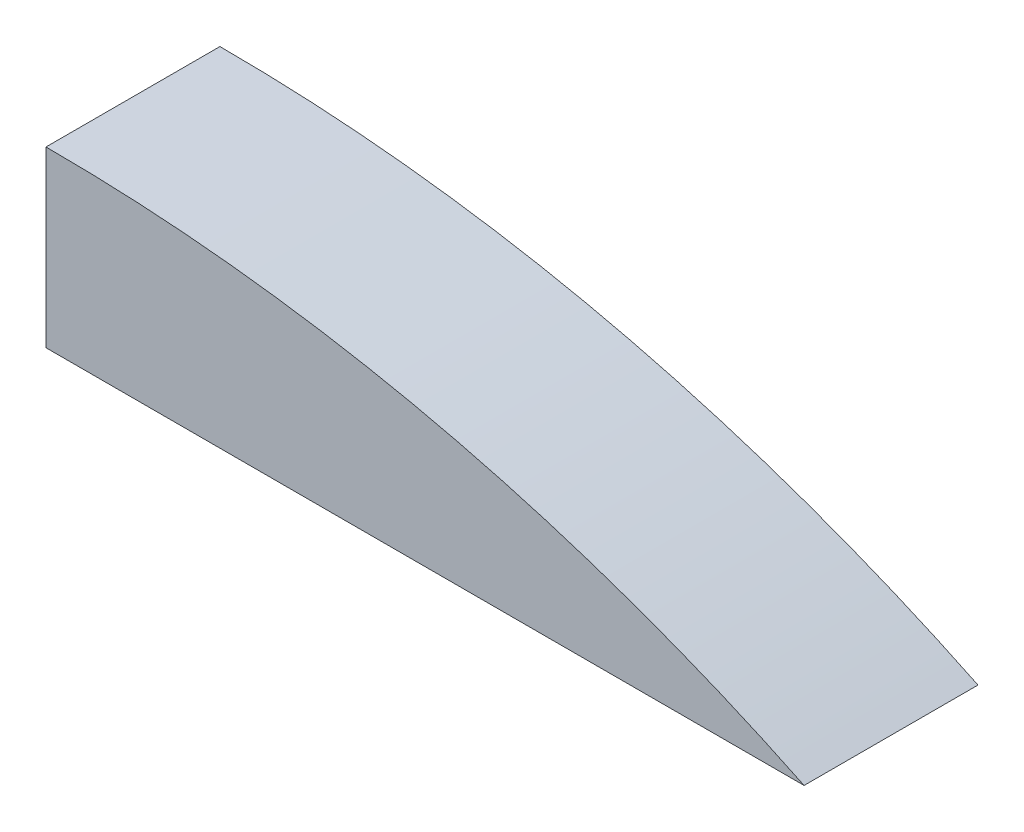
ISO-10303-21;
HEADER;
FILE_DESCRIPTION(('STEP AP214'),'2;1');
FILE_NAME('part.step','',(''),(''),'','','');
FILE_SCHEMA(('AUTOMOTIVE_DESIGN { 1 0 10303 214 1 1 1 1 }'));
ENDSEC;
DATA;
#1=APPLICATION_CONTEXT('core data for automotive mechanical design processes');
#2=APPLICATION_PROTOCOL_DEFINITION('international standard','automotive_design',2000,#1);
#3=PRODUCT_CONTEXT('',#1,'mechanical');
#4=PRODUCT('Part','Part','',(#3));
#5=PRODUCT_RELATED_PRODUCT_CATEGORY('part','',(#4));
#6=PRODUCT_DEFINITION_FORMATION('','',#4);
#7=PRODUCT_DEFINITION_CONTEXT('part definition',#1,'design');
#8=PRODUCT_DEFINITION('design','',#6,#7);
#9=PRODUCT_DEFINITION_SHAPE('','',#8);
#10=(LENGTH_UNIT() NAMED_UNIT(*) SI_UNIT(.MILLI.,.METRE.));
#11=(NAMED_UNIT(*) PLANE_ANGLE_UNIT() SI_UNIT($,.RADIAN.));
#12=(NAMED_UNIT(*) SI_UNIT($,.STERADIAN.) SOLID_ANGLE_UNIT());
#13=UNCERTAINTY_MEASURE_WITH_UNIT(LENGTH_MEASURE(1.E-05),#10,'distance_accuracy_value','');
#14=(GEOMETRIC_REPRESENTATION_CONTEXT(3) GLOBAL_UNCERTAINTY_ASSIGNED_CONTEXT((#13)) GLOBAL_UNIT_ASSIGNED_CONTEXT((#10,
#11,#12)) REPRESENTATION_CONTEXT('',''));
#15=CARTESIAN_POINT('',(0.,0.,0.));
#16=DIRECTION('',(0.,0.,1.));
#17=DIRECTION('',(1.,0.,0.));
#18=AXIS2_PLACEMENT_3D('',#15,#16,#17);
#19=CARTESIAN_POINT('',(597.266258042068,0.,0.));
#20=DIRECTION('',(-1.,0.,0.));
#21=DIRECTION('',(0.,0.,1.));
#22=AXIS2_PLACEMENT_3D('',#19,#20,#21);
#23=PLANE('',#22);
#24=DIRECTION('',(0.,0.,-1.));
#25=VECTOR('',#24,1.);
#26=CARTESIAN_POINT('',(597.266258042068,50.,80.));
#27=LINE('',#26,#25);
#28=CARTESIAN_POINT('',(597.266258042068,50.,5.));
#29=VERTEX_POINT('',#28);
#30=CARTESIAN_POINT('',(597.266258042068,50.,0.));
#31=VERTEX_POINT('',#30);
#32=EDGE_CURVE('E78',#29,#31,#27,.T.);
#33=ORIENTED_EDGE('',*,*,#32,.T.);
#34=DIRECTION('',(0.,-1.,0.));
#35=VECTOR('',#34,1.);
#36=CARTESIAN_POINT('',(597.266258042068,0.,0.));
#37=LINE('',#36,#35);
#38=CARTESIAN_POINT('',(597.266258042068,45.,0.));
#39=VERTEX_POINT('',#38);
#40=EDGE_CURVE('E83',#31,#39,#37,.T.);
#41=ORIENTED_EDGE('',*,*,#40,.T.);
#42=DIRECTION('',(0.,0.,-1.));
#43=VECTOR('',#42,1.);
#44=CARTESIAN_POINT('',(597.266258042068,45.,0.));
#45=LINE('',#44,#43);
#46=CARTESIAN_POINT('',(597.266258042068,45.,5.));
#47=VERTEX_POINT('',#46);
#48=EDGE_CURVE('E79',#47,#39,#45,.T.);
#49=ORIENTED_EDGE('',*,*,#48,.F.);
#50=DIRECTION('',(0.,-1.,0.));
#51=VECTOR('',#50,1.);
#52=CARTESIAN_POINT('',(597.266258042068,-45.,5.));
#53=LINE('',#52,#51);
#54=EDGE_CURVE('E68',#29,#47,#53,.T.);
#55=ORIENTED_EDGE('',*,*,#54,.F.);
#56=EDGE_LOOP('',(#33,#41,#49,#55));
#57=FACE_BOUND('',#56,.T.);
#58=ADVANCED_FACE('F34',(#57),#23,.T.);
#59=CARTESIAN_POINT('',(-502.733741957931,0.,0.));
#60=DIRECTION('',(0.,0.,1.));
#61=DIRECTION('',(1.,0.,0.));
#62=AXIS2_PLACEMENT_3D('',#59,#60,#61);
#63=PLANE('',#62);
#64=ORIENTED_EDGE('',*,*,#40,.F.);
#65=CARTESIAN_POINT('',(597.266258042068,0.,0.));
#66=DIRECTION('',(0.,0.,1.));
#67=DIRECTION('',(1.,0.,0.));
#68=AXIS2_PLACEMENT_3D('',#65,#66,#67);
#69=CIRCLE('',#68,50.);
#70=CARTESIAN_POINT('',(619.060752759772,45.,0.));
#71=VERTEX_POINT('',#70);
#72=EDGE_CURVE('E73',#71,#31,#69,.T.);
#73=ORIENTED_EDGE('',*,*,#72,.F.);
#74=DIRECTION('',(1.,0.,0.));
#75=VECTOR('',#74,1.);
#76=CARTESIAN_POINT('',(-502.733741957931,45.,0.));
#77=LINE('',#76,#75);
#78=EDGE_CURVE('E38',#39,#71,#77,.T.);
#79=ORIENTED_EDGE('',*,*,#78,.F.);
#80=EDGE_LOOP('',(#64,#73,#79));
#81=FACE_BOUND('',#80,.T.);
#82=ADVANCED_FACE('F90',(#81),#63,.F.);
#83=CARTESIAN_POINT('',(0.,45.,0.));
#84=DIRECTION('',(0.,-1.,0.));
#85=DIRECTION('',(0.,0.,-1.));
#86=AXIS2_PLACEMENT_3D('',#83,#84,#85);
#87=PLANE('',#86);
#88=DIRECTION('',(1.,0.,0.));
#89=VECTOR('',#88,1.);
#90=CARTESIAN_POINT('',(597.266258042068,45.,5.));
#91=LINE('',#90,#89);
#92=CARTESIAN_POINT('',(619.060752759772,45.,5.));
#93=VERTEX_POINT('',#92);
#94=EDGE_CURVE('E56',#47,#93,#91,.T.);
#95=ORIENTED_EDGE('',*,*,#94,.F.);
#96=ORIENTED_EDGE('',*,*,#48,.T.);
#97=ORIENTED_EDGE('',*,*,#78,.T.);
#98=DIRECTION('',(0.,0.,-1.));
#99=VECTOR('',#98,1.);
#100=CARTESIAN_POINT('',(619.060752759772,45.,80.));
#101=LINE('',#100,#99);
#102=EDGE_CURVE('E11',#71,#93,#101,.F.);
#103=ORIENTED_EDGE('',*,*,#102,.T.);
#104=EDGE_LOOP('',(#95,#96,#97,#103));
#105=FACE_BOUND('',#104,.T.);
#106=ADVANCED_FACE('F88',(#105),#87,.T.);
#107=CARTESIAN_POINT('',(597.266258042068,0.,80.));
#108=DIRECTION('',(0.,0.,-1.));
#109=DIRECTION('',(-1.,0.,0.));
#110=AXIS2_PLACEMENT_3D('',#107,#108,#109);
#111=CYLINDRICAL_SURFACE('',#110,50.);
#112=ORIENTED_EDGE('',*,*,#102,.F.);
#113=ORIENTED_EDGE('',*,*,#72,.T.);
#114=ORIENTED_EDGE('',*,*,#32,.F.);
#115=CARTESIAN_POINT('',(597.266258042068,0.,5.));
#116=DIRECTION('',(0.,0.,1.));
#117=DIRECTION('',(1.,0.,0.));
#118=AXIS2_PLACEMENT_3D('',#115,#116,#117);
#119=CIRCLE('',#118,50.);
#120=EDGE_CURVE('E66',#93,#29,#119,.T.);
#121=ORIENTED_EDGE('',*,*,#120,.F.);
#122=EDGE_LOOP('',(#112,#113,#114,#121));
#123=FACE_BOUND('',#122,.T.);
#124=ADVANCED_FACE('F81',(#123),#111,.T.);
#125=CARTESIAN_POINT('',(597.266258042068,-45.,5.));
#126=DIRECTION('',(0.,0.,1.));
#127=DIRECTION('',(1.,0.,0.));
#128=AXIS2_PLACEMENT_3D('',#125,#126,#127);
#129=PLANE('',#128);
#130=ORIENTED_EDGE('',*,*,#120,.T.);
#131=ORIENTED_EDGE('',*,*,#54,.T.);
#132=ORIENTED_EDGE('',*,*,#94,.T.);
#133=EDGE_LOOP('',(#130,#131,#132));
#134=FACE_BOUND('',#133,.T.);
#135=ADVANCED_FACE('F36',(#134),#129,.T.);
#136=CLOSED_SHELL('',(#58,#82,#106,#124,#135));
#137=MANIFOLD_SOLID_BREP('B2',#136);
#138=ADVANCED_BREP_SHAPE_REPRESENTATION('',(#18,#137),#14);
#139=SHAPE_DEFINITION_REPRESENTATION(#9,#138);
ENDSEC;
END-ISO-10303-21;
